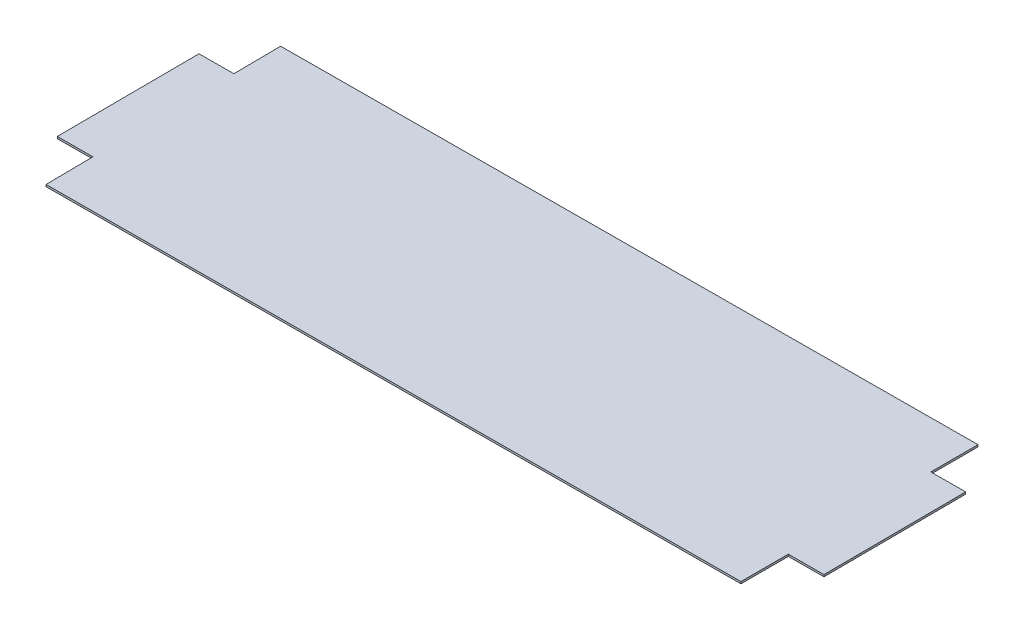
ISO-10303-21;
HEADER;
FILE_DESCRIPTION(('STEP AP214'),'2;1');
FILE_NAME('part.step','',(''),(''),'','','');
FILE_SCHEMA(('AUTOMOTIVE_DESIGN { 1 0 10303 214 1 1 1 1 }'));
ENDSEC;
DATA;
#1=APPLICATION_CONTEXT('core data for automotive mechanical design processes');
#2=APPLICATION_PROTOCOL_DEFINITION('international standard','automotive_design',2000,#1);
#3=PRODUCT_CONTEXT('',#1,'mechanical');
#4=PRODUCT('Part','Part','',(#3));
#5=PRODUCT_RELATED_PRODUCT_CATEGORY('part','',(#4));
#6=PRODUCT_DEFINITION_FORMATION('','',#4);
#7=PRODUCT_DEFINITION_CONTEXT('part definition',#1,'design');
#8=PRODUCT_DEFINITION('design','',#6,#7);
#9=PRODUCT_DEFINITION_SHAPE('','',#8);
#10=(LENGTH_UNIT() NAMED_UNIT(*) SI_UNIT(.MILLI.,.METRE.));
#11=(NAMED_UNIT(*) PLANE_ANGLE_UNIT() SI_UNIT($,.RADIAN.));
#12=(NAMED_UNIT(*) SI_UNIT($,.STERADIAN.) SOLID_ANGLE_UNIT());
#13=UNCERTAINTY_MEASURE_WITH_UNIT(LENGTH_MEASURE(1.E-05),#10,'distance_accuracy_value','');
#14=(GEOMETRIC_REPRESENTATION_CONTEXT(3) GLOBAL_UNCERTAINTY_ASSIGNED_CONTEXT((#13)) GLOBAL_UNIT_ASSIGNED_CONTEXT((#10,
#11,#12)) REPRESENTATION_CONTEXT('',''));
#15=CARTESIAN_POINT('',(0.,0.,0.));
#16=DIRECTION('',(0.,0.,1.));
#17=DIRECTION('',(1.,0.,0.));
#18=AXIS2_PLACEMENT_3D('',#15,#16,#17);
#19=CARTESIAN_POINT('',(-610.405271528689,1.94289029309402E-13,193.675));
#20=DIRECTION('',(0.,-1.,0.));
#21=DIRECTION('',(0.,0.,-1.));
#22=AXIS2_PLACEMENT_3D('',#19,#20,#21);
#23=PLANE('',#22);
#24=DIRECTION('',(0.999986563434071,0.,-0.00518391274192354));
#25=VECTOR('',#24,1.);
#26=CARTESIAN_POINT('',(-1189.15704506782,1.94289029309402E-13,310.976774826291));
#27=LINE('',#26,#25);
#28=CARTESIAN_POINT('',(-1165.7524817417,1.94289029309402E-13,310.855445982003));
#29=VERTEX_POINT('',#28);
#30=CARTESIAN_POINT('',(-1222.77001415093,1.94939550612893E-13,311.151023866324));
#31=VERTEX_POINT('',#30);
#32=EDGE_CURVE('E17',#29,#31,#27,.F.);
#33=ORIENTED_EDGE('',*,*,#32,.F.);
#34=DIRECTION('',(0.0103676861758763,0.,0.999946254097368));
#35=VECTOR('',#34,1.);
#36=CARTESIAN_POINT('',(-1165.22914877007,1.94289029309402E-13,361.330049066521));
#37=LINE('',#36,#35);
#38=CARTESIAN_POINT('',(-1164.96245343983,1.94668500069772E-13,387.052374369274));
#39=VERTEX_POINT('',#38);
#40=EDGE_CURVE('E164',#39,#29,#37,.F.);
#41=ORIENTED_EDGE('',*,*,#40,.F.);
#42=DIRECTION('',(0.999986563434072,0.,-0.0051839127419233));
#43=VECTOR('',#42,1.);
#44=CARTESIAN_POINT('',(-609.4149533625,1.96023752785379E-13,384.172425908263));
#45=LINE('',#44,#43);
#46=CARTESIAN_POINT('',(-53.8730188628722,1.94668500069772E-13,381.292506299107));
#47=VERTEX_POINT('',#46);
#48=EDGE_CURVE('E162',#47,#39,#45,.F.);
#49=ORIENTED_EDGE('',*,*,#48,.F.);
#50=DIRECTION('',(0.,0.,1.));
#51=VECTOR('',#50,1.);
#52=CARTESIAN_POINT('',(-53.8730188628722,1.94289029309402E-13,361.627768309912));
#53=LINE('',#52,#51);
#54=CARTESIAN_POINT('',(-53.8730188628722,1.94289029309402E-13,305.091482419026));
#55=VERTEX_POINT('',#54);
#56=EDGE_CURVE('E156',#47,#55,#53,.F.);
#57=ORIENTED_EDGE('',*,*,#56,.T.);
#58=DIRECTION('',(-0.999986563434071,0.,0.00518391274192366));
#59=VECTOR('',#58,1.);
#60=CARTESIAN_POINT('',(-30.1726465724989,1.94289029309402E-13,304.968620106274));
#61=LINE('',#60,#59);
#62=CARTESIAN_POINT('',(3.14451354636017,1.95590071916385E-13,304.795904534705));
#63=VERTEX_POINT('',#62);
#64=EDGE_CURVE('E151',#55,#63,#61,.F.);
#65=ORIENTED_EDGE('',*,*,#64,.T.);
#66=DIRECTION('',(-0.00518391274192348,0.,-0.999986563434072));
#67=VECTOR('',#66,1.);
#68=CARTESIAN_POINT('',(2.53553339700272,1.96023752785379E-13,187.322482995288));
#69=LINE('',#68,#67);
#70=CARTESIAN_POINT('',(1.95797601733439,1.94668500069772E-13,75.9105731053427));
#71=VERTEX_POINT('',#70);
#72=EDGE_CURVE('E147',#71,#63,#69,.F.);
#73=ORIENTED_EDGE('',*,*,#72,.F.);
#74=DIRECTION('',(-0.999986563434071,0.,0.00518391274192342));
#75=VECTOR('',#74,1.);
#76=CARTESIAN_POINT('',(-23.4628131862811,1.94289029309402E-13,76.0423540290881));
#77=LINE('',#76,#75);
#78=CARTESIAN_POINT('',(-53.8730188628722,1.94289029309402E-13,76.2));
#79=VERTEX_POINT('',#78);
#80=EDGE_CURVE('E139',#79,#71,#77,.F.);
#81=ORIENTED_EDGE('',*,*,#80,.F.);
#82=DIRECTION('',(0.,0.,-1.));
#83=VECTOR('',#82,1.);
#84=CARTESIAN_POINT('',(-53.8730188628722,1.94289029309402E-13,41.8810529172602));
#85=LINE('',#84,#83);
#86=CARTESIAN_POINT('',(-53.8730188628721,1.95590071916385E-13,0.287386898701172));
#87=VERTEX_POINT('',#86);
#88=EDGE_CURVE('E136',#87,#79,#85,.F.);
#89=ORIENTED_EDGE('',*,*,#88,.F.);
#90=DIRECTION('',(0.999986563434072,0.,-0.0051839127419233));
#91=VECTOR('',#90,1.);
#92=CARTESIAN_POINT('',(-611.390024117172,1.96023752785379E-13,3.17754523988095));
#93=LINE('',#92,#91);
#94=CARTESIAN_POINT('',(-1168.91259494918,1.94939550612893E-13,6.06773243291756));
#95=VERTEX_POINT('',#94);
#96=EDGE_CURVE('E129',#87,#95,#93,.F.);
#97=ORIENTED_EDGE('',*,*,#96,.T.);
#98=DIRECTION('',(-0.0103676861758764,0.,-0.999946254097368));
#99=VECTOR('',#98,1.);
#100=CARTESIAN_POINT('',(-1168.73533621879,1.94289029309402E-13,23.1640449998506));
#101=LINE('',#100,#99);
#102=CARTESIAN_POINT('',(-1168.12555679975,1.94289029309402E-13,81.9762655423045));
#103=VERTEX_POINT('',#102);
#104=EDGE_CURVE('E125',#95,#103,#101,.F.);
#105=ORIENTED_EDGE('',*,*,#104,.T.);
#106=DIRECTION('',(0.999986563434071,0.,-0.00518391274192379));
#107=VECTOR('',#106,1.);
#108=CARTESIAN_POINT('',(-1196.38264585544,1.94289029309402E-13,82.1227497945552));
#109=LINE('',#108,#107);
#110=CARTESIAN_POINT('',(-1223.95655167996,1.95047970830142E-13,82.2656924369618));
#111=VERTEX_POINT('',#110);
#112=EDGE_CURVE('E107',#103,#111,#109,.F.);
#113=ORIENTED_EDGE('',*,*,#112,.T.);
#114=DIRECTION('',(-0.00518391274192348,0.,-0.999986563434072));
#115=VECTOR('',#114,1.);
#116=CARTESIAN_POINT('',(-1223.37899430029,1.96023752785379E-13,193.677602326907));
#117=LINE('',#116,#115);
#118=EDGE_CURVE('E101',#111,#31,#117,.F.);
#119=ORIENTED_EDGE('',*,*,#118,.T.);
#120=EDGE_LOOP('',(#33,#41,#49,#57,#65,#73,#81,#89,#97,#105,#113,#119));
#121=FACE_BOUND('',#120,.T.);
#122=ADVANCED_FACE('F14',(#121),#23,.F.);
#123=CARTESIAN_POINT('',(-1189.15704506782,-3.1749999999998,310.976774826291));
#124=DIRECTION('',(0.00518391274192354,0.,0.999986563434071));
#125=DIRECTION('',(0.999986563434071,0.,-0.00518391274192354));
#126=AXIS2_PLACEMENT_3D('',#123,#124,#125);
#127=PLANE('',#126);
#128=DIRECTION('',(-0.999986563434071,0.,0.00518391274192392));
#129=VECTOR('',#128,1.);
#130=CARTESIAN_POINT('',(-1165.7524817417,-3.1749999999998,310.855445982003));
#131=LINE('',#130,#129);
#132=CARTESIAN_POINT('',(-1165.7524817417,-3.1749999999998,310.855445982003));
#133=VERTEX_POINT('',#132);
#134=CARTESIAN_POINT('',(-1222.77001415093,-3.1749999999998,311.151023866324));
#135=VERTEX_POINT('',#134);
#136=EDGE_CURVE('E168',#133,#135,#131,.T.);
#137=ORIENTED_EDGE('',*,*,#136,.F.);
#138=DIRECTION('',(0.,1.,0.));
#139=VECTOR('',#138,1.);
#140=CARTESIAN_POINT('',(-1165.75248174171,-3.1749999999998,310.855445982003));
#141=LINE('',#140,#139);
#142=EDGE_CURVE('E114',#29,#133,#141,.F.);
#143=ORIENTED_EDGE('',*,*,#142,.F.);
#144=ORIENTED_EDGE('',*,*,#32,.T.);
#145=DIRECTION('',(0.,1.,0.));
#146=VECTOR('',#145,1.);
#147=CARTESIAN_POINT('',(-1222.77001415093,-3.1749999999998,311.151023866324));
#148=LINE('',#147,#146);
#149=EDGE_CURVE('E109',#31,#135,#148,.F.);
#150=ORIENTED_EDGE('',*,*,#149,.T.);
#151=EDGE_LOOP('',(#137,#143,#144,#150));
#152=FACE_BOUND('',#151,.T.);
#153=ADVANCED_FACE('F111',(#152),#127,.T.);
#154=CARTESIAN_POINT('',(-1223.37899430029,-3.1749999999998,193.677602326907));
#155=DIRECTION('',(0.999986563434072,0.,-0.00518391274192348));
#156=DIRECTION('',(-0.00518391274192348,0.,-0.999986563434072));
#157=AXIS2_PLACEMENT_3D('',#154,#155,#156);
#158=PLANE('',#157);
#159=ORIENTED_EDGE('',*,*,#149,.F.);
#160=ORIENTED_EDGE('',*,*,#118,.F.);
#161=DIRECTION('',(0.,1.,0.));
#162=VECTOR('',#161,1.);
#163=CARTESIAN_POINT('',(-1223.95655167996,-3.1749999999998,82.2656924369618));
#164=LINE('',#163,#162);
#165=CARTESIAN_POINT('',(-1223.95655167996,-3.1749999999998,82.2656924369618));
#166=VERTEX_POINT('',#165);
#167=EDGE_CURVE('E120',#111,#166,#164,.F.);
#168=ORIENTED_EDGE('',*,*,#167,.T.);
#169=DIRECTION('',(-0.00518391274194227,0.,-0.999986563434071));
#170=VECTOR('',#169,1.);
#171=CARTESIAN_POINT('',(-1222.77001415093,-3.1749999999998,311.151023866324));
#172=LINE('',#171,#170);
#173=EDGE_CURVE('E118',#135,#166,#172,.T.);
#174=ORIENTED_EDGE('',*,*,#173,.F.);
#175=EDGE_LOOP('',(#159,#160,#168,#174));
#176=FACE_BOUND('',#175,.T.);
#177=ADVANCED_FACE('F116',(#176),#158,.F.);
#178=CARTESIAN_POINT('',(-1196.38264585544,-3.1749999999998,82.1227497945552));
#179=DIRECTION('',(0.00518391274192379,0.,0.999986563434071));
#180=DIRECTION('',(0.999986563434071,0.,-0.00518391274192379));
#181=AXIS2_PLACEMENT_3D('',#178,#179,#180);
#182=PLANE('',#181);
#183=DIRECTION('',(0.,1.,0.));
#184=VECTOR('',#183,1.);
#185=CARTESIAN_POINT('',(-1168.12555679975,-3.1749999999998,81.9762655423045));
#186=LINE('',#185,#184);
#187=CARTESIAN_POINT('',(-1168.12555679975,-3.1749999999998,81.9762655423045));
#188=VERTEX_POINT('',#187);
#189=EDGE_CURVE('E127',#103,#188,#186,.F.);
#190=ORIENTED_EDGE('',*,*,#189,.T.);
#191=DIRECTION('',(0.999986563434071,0.,-0.00518391274192459));
#192=VECTOR('',#191,1.);
#193=CARTESIAN_POINT('',(-1223.95655167996,-3.1749999999998,82.2656924369619));
#194=LINE('',#193,#192);
#195=EDGE_CURVE('E171',#166,#188,#194,.T.);
#196=ORIENTED_EDGE('',*,*,#195,.F.);
#197=ORIENTED_EDGE('',*,*,#167,.F.);
#198=ORIENTED_EDGE('',*,*,#112,.F.);
#199=EDGE_LOOP('',(#190,#196,#197,#198));
#200=FACE_BOUND('',#199,.T.);
#201=ADVANCED_FACE('F241',(#200),#182,.F.);
#202=CARTESIAN_POINT('',(-1168.73533621879,-3.1749999999998,23.1640449998506));
#203=DIRECTION('',(0.999946254097368,0.,-0.0103676861758764));
#204=DIRECTION('',(-0.0103676861758764,0.,-0.999946254097368));
#205=AXIS2_PLACEMENT_3D('',#202,#203,#204);
#206=PLANE('',#205);
#207=ORIENTED_EDGE('',*,*,#189,.F.);
#208=ORIENTED_EDGE('',*,*,#104,.F.);
#209=DIRECTION('',(0.,1.,0.));
#210=VECTOR('',#209,1.);
#211=CARTESIAN_POINT('',(-1168.91259494918,-3.1749999999998,6.0677324329176));
#212=LINE('',#211,#210);
#213=CARTESIAN_POINT('',(-1168.91259494918,-3.1749999999998,6.06773243291754));
#214=VERTEX_POINT('',#213);
#215=EDGE_CURVE('E131',#95,#214,#212,.F.);
#216=ORIENTED_EDGE('',*,*,#215,.T.);
#217=DIRECTION('',(-0.0103676861759444,0.,-0.999946254097368));
#218=VECTOR('',#217,1.);
#219=CARTESIAN_POINT('',(-1168.12555679975,-3.1749999999998,81.9762655423045));
#220=LINE('',#219,#218);
#221=EDGE_CURVE('E174',#188,#214,#220,.T.);
#222=ORIENTED_EDGE('',*,*,#221,.F.);
#223=EDGE_LOOP('',(#207,#208,#216,#222));
#224=FACE_BOUND('',#223,.T.);
#225=ADVANCED_FACE('F237',(#224),#206,.F.);
#226=CARTESIAN_POINT('',(-611.390024117172,-3.1749999999998,3.17754523988095));
#227=DIRECTION('',(0.0051839127419233,0.,0.999986563434072));
#228=DIRECTION('',(0.999986563434072,0.,-0.0051839127419233));
#229=AXIS2_PLACEMENT_3D('',#226,#227,#228);
#230=PLANE('',#229);
#231=DIRECTION('',(0.999986563434071,0.,-0.00518391274192324));
#232=VECTOR('',#231,1.);
#233=CARTESIAN_POINT('',(-1168.91259494918,-3.1749999999998,6.06773243291753));
#234=LINE('',#233,#232);
#235=CARTESIAN_POINT('',(-53.8730188628721,-3.1749999999998,0.287386898701172));
#236=VERTEX_POINT('',#235);
#237=EDGE_CURVE('E177',#214,#236,#234,.T.);
#238=ORIENTED_EDGE('',*,*,#237,.F.);
#239=ORIENTED_EDGE('',*,*,#215,.F.);
#240=ORIENTED_EDGE('',*,*,#96,.F.);
#241=DIRECTION('',(0.,1.,0.));
#242=VECTOR('',#241,1.);
#243=CARTESIAN_POINT('',(-53.8730188628722,-3.1749999999998,0.287386898701177));
#244=LINE('',#243,#242);
#245=EDGE_CURVE('E133',#236,#87,#244,.T.);
#246=ORIENTED_EDGE('',*,*,#245,.F.);
#247=EDGE_LOOP('',(#238,#239,#240,#246));
#248=FACE_BOUND('',#247,.T.);
#249=ADVANCED_FACE('F233',(#248),#230,.F.);
#250=CARTESIAN_POINT('',(-53.8730188628722,-3.1749999999998,41.8810529172602));
#251=DIRECTION('',(1.,0.,0.));
#252=DIRECTION('',(0.,0.,-1.));
#253=AXIS2_PLACEMENT_3D('',#250,#251,#252);
#254=PLANE('',#253);
#255=DIRECTION('',(0.,1.,0.));
#256=VECTOR('',#255,1.);
#257=CARTESIAN_POINT('',(-53.8730188628722,-3.1749999999998,76.2));
#258=LINE('',#257,#256);
#259=CARTESIAN_POINT('',(-53.8730188628722,-3.1749999999998,76.2));
#260=VERTEX_POINT('',#259);
#261=EDGE_CURVE('E141',#260,#79,#258,.T.);
#262=ORIENTED_EDGE('',*,*,#261,.F.);
#263=DIRECTION('',(0.,0.,-1.));
#264=VECTOR('',#263,1.);
#265=CARTESIAN_POINT('',(-53.8730188628722,-3.1749999999998,193.675));
#266=LINE('',#265,#264);
#267=EDGE_CURVE('E180',#236,#260,#266,.F.);
#268=ORIENTED_EDGE('',*,*,#267,.F.);
#269=ORIENTED_EDGE('',*,*,#245,.T.);
#270=ORIENTED_EDGE('',*,*,#88,.T.);
#271=EDGE_LOOP('',(#262,#268,#269,#270));
#272=FACE_BOUND('',#271,.T.);
#273=ADVANCED_FACE('F229',(#272),#254,.T.);
#274=CARTESIAN_POINT('',(-23.4628131862811,-3.1749999999998,76.0423540290881));
#275=DIRECTION('',(-0.00518391274192342,0.,-0.999986563434071));
#276=DIRECTION('',(-0.999986563434071,0.,0.00518391274192342));
#277=AXIS2_PLACEMENT_3D('',#274,#275,#276);
#278=PLANE('',#277);
#279=DIRECTION('',(0.999986563434071,0.,-0.00518391274192317));
#280=VECTOR('',#279,1.);
#281=CARTESIAN_POINT('',(-53.8730188628722,-3.1749999999998,76.2));
#282=LINE('',#281,#280);
#283=CARTESIAN_POINT('',(1.95797601733439,-3.1749999999998,75.9105731053427));
#284=VERTEX_POINT('',#283);
#285=EDGE_CURVE('E183',#260,#284,#282,.T.);
#286=ORIENTED_EDGE('',*,*,#285,.F.);
#287=ORIENTED_EDGE('',*,*,#261,.T.);
#288=ORIENTED_EDGE('',*,*,#80,.T.);
#289=DIRECTION('',(0.,1.,0.));
#290=VECTOR('',#289,1.);
#291=CARTESIAN_POINT('',(1.95797601733439,-3.1749999999998,75.9105731053427));
#292=LINE('',#291,#290);
#293=EDGE_CURVE('E144',#284,#71,#292,.T.);
#294=ORIENTED_EDGE('',*,*,#293,.F.);
#295=EDGE_LOOP('',(#286,#287,#288,#294));
#296=FACE_BOUND('',#295,.T.);
#297=ADVANCED_FACE('F225',(#296),#278,.T.);
#298=CARTESIAN_POINT('',(2.53553339700272,-3.1749999999998,187.322482995288));
#299=DIRECTION('',(0.999986563434072,0.,-0.00518391274192348));
#300=DIRECTION('',(-0.00518391274192348,0.,-0.999986563434072));
#301=AXIS2_PLACEMENT_3D('',#298,#299,#300);
#302=PLANE('',#301);
#303=ORIENTED_EDGE('',*,*,#72,.T.);
#304=DIRECTION('',(0.,1.,0.));
#305=VECTOR('',#304,1.);
#306=CARTESIAN_POINT('',(3.14451354636019,-3.1749999999998,304.795904534705));
#307=LINE('',#306,#305);
#308=CARTESIAN_POINT('',(3.14451354636017,-3.1749999999998,304.795904534705));
#309=VERTEX_POINT('',#308);
#310=EDGE_CURVE('E149',#63,#309,#307,.F.);
#311=ORIENTED_EDGE('',*,*,#310,.T.);
#312=DIRECTION('',(0.00518391274192335,0.,0.999986563434071));
#313=VECTOR('',#312,1.);
#314=CARTESIAN_POINT('',(1.95797601733438,-3.1749999999998,75.9105731053427));
#315=LINE('',#314,#313);
#316=EDGE_CURVE('E186',#284,#309,#315,.T.);
#317=ORIENTED_EDGE('',*,*,#316,.F.);
#318=ORIENTED_EDGE('',*,*,#293,.T.);
#319=EDGE_LOOP('',(#303,#311,#317,#318));
#320=FACE_BOUND('',#319,.T.);
#321=ADVANCED_FACE('F221',(#320),#302,.T.);
#322=CARTESIAN_POINT('',(-30.1726465724989,-3.1749999999998,304.968620106274));
#323=DIRECTION('',(-0.00518391274192366,0.,-0.999986563434071));
#324=DIRECTION('',(-0.999986563434071,0.,0.00518391274192366));
#325=AXIS2_PLACEMENT_3D('',#322,#323,#324);
#326=PLANE('',#325);
#327=DIRECTION('',(0.,1.,0.));
#328=VECTOR('',#327,1.);
#329=CARTESIAN_POINT('',(-53.8730188628722,-3.1749999999998,305.091482419026));
#330=LINE('',#329,#328);
#331=CARTESIAN_POINT('',(-53.8730188628722,-3.1749999999998,305.091482419026));
#332=VERTEX_POINT('',#331);
#333=EDGE_CURVE('E154',#55,#332,#330,.F.);
#334=ORIENTED_EDGE('',*,*,#333,.T.);
#335=DIRECTION('',(-0.999986563434071,0.,0.0051839127419237));
#336=VECTOR('',#335,1.);
#337=CARTESIAN_POINT('',(3.14451354636014,-3.1749999999998,304.795904534705));
#338=LINE('',#337,#336);
#339=EDGE_CURVE('E189',#309,#332,#338,.T.);
#340=ORIENTED_EDGE('',*,*,#339,.F.);
#341=ORIENTED_EDGE('',*,*,#310,.F.);
#342=ORIENTED_EDGE('',*,*,#64,.F.);
#343=EDGE_LOOP('',(#334,#340,#341,#342));
#344=FACE_BOUND('',#343,.T.);
#345=ADVANCED_FACE('F218',(#344),#326,.F.);
#346=CARTESIAN_POINT('',(-53.8730188628722,-3.1749999999998,361.627768309912));
#347=DIRECTION('',(-1.,0.,0.));
#348=DIRECTION('',(0.,0.,1.));
#349=AXIS2_PLACEMENT_3D('',#346,#347,#348);
#350=PLANE('',#349);
#351=DIRECTION('',(0.,1.,0.));
#352=VECTOR('',#351,1.);
#353=CARTESIAN_POINT('',(-53.8730188628721,-3.1749999999998,381.292506299108));
#354=LINE('',#353,#352);
#355=CARTESIAN_POINT('',(-53.8730188628722,-3.1749999999998,381.292506299107));
#356=VERTEX_POINT('',#355);
#357=EDGE_CURVE('E159',#356,#47,#354,.T.);
#358=ORIENTED_EDGE('',*,*,#357,.F.);
#359=DIRECTION('',(0.,0.,-1.));
#360=VECTOR('',#359,1.);
#361=CARTESIAN_POINT('',(-53.8730188628722,-3.1749999999998,193.675));
#362=LINE('',#361,#360);
#363=EDGE_CURVE('E192',#332,#356,#362,.F.);
#364=ORIENTED_EDGE('',*,*,#363,.F.);
#365=ORIENTED_EDGE('',*,*,#333,.F.);
#366=ORIENTED_EDGE('',*,*,#56,.F.);
#367=EDGE_LOOP('',(#358,#364,#365,#366));
#368=FACE_BOUND('',#367,.T.);
#369=ADVANCED_FACE('F202',(#368),#350,.F.);
#370=CARTESIAN_POINT('',(-609.4149533625,-3.1749999999998,384.172425908263));
#371=DIRECTION('',(0.0051839127419233,0.,0.999986563434072));
#372=DIRECTION('',(0.999986563434072,0.,-0.0051839127419233));
#373=AXIS2_PLACEMENT_3D('',#370,#371,#372);
#374=PLANE('',#373);
#375=ORIENTED_EDGE('',*,*,#357,.T.);
#376=ORIENTED_EDGE('',*,*,#48,.T.);
#377=DIRECTION('',(0.,1.,0.));
#378=VECTOR('',#377,1.);
#379=CARTESIAN_POINT('',(-1164.96245343984,-3.1749999999998,387.052374369274));
#380=LINE('',#379,#378);
#381=CARTESIAN_POINT('',(-1164.96245343983,-3.1749999999998,387.052374369274));
#382=VERTEX_POINT('',#381);
#383=EDGE_CURVE('E32',#382,#39,#380,.T.);
#384=ORIENTED_EDGE('',*,*,#383,.F.);
#385=DIRECTION('',(-0.999986563434071,0.,0.00518391274192337));
#386=VECTOR('',#385,1.);
#387=CARTESIAN_POINT('',(-53.8730188628722,-3.1749999999998,381.292506299107));
#388=LINE('',#387,#386);
#389=EDGE_CURVE('E23',#356,#382,#388,.T.);
#390=ORIENTED_EDGE('',*,*,#389,.F.);
#391=EDGE_LOOP('',(#375,#376,#384,#390));
#392=FACE_BOUND('',#391,.T.);
#393=ADVANCED_FACE('F199',(#392),#374,.T.);
#394=CARTESIAN_POINT('',(-1165.22914877007,-3.1749999999998,361.330049066521));
#395=DIRECTION('',(-0.999946254097368,0.,0.0103676861758763));
#396=DIRECTION('',(0.0103676861758763,0.,0.999946254097368));
#397=AXIS2_PLACEMENT_3D('',#394,#395,#396);
#398=PLANE('',#397);
#399=DIRECTION('',(-0.010367686175888,0.,-0.999946254097368));
#400=VECTOR('',#399,1.);
#401=CARTESIAN_POINT('',(-1164.96245343983,-3.1749999999998,387.052374369274));
#402=LINE('',#401,#400);
#403=EDGE_CURVE('E9',#382,#133,#402,.T.);
#404=ORIENTED_EDGE('',*,*,#403,.F.);
#405=ORIENTED_EDGE('',*,*,#383,.T.);
#406=ORIENTED_EDGE('',*,*,#40,.T.);
#407=ORIENTED_EDGE('',*,*,#142,.T.);
#408=EDGE_LOOP('',(#404,#405,#406,#407));
#409=FACE_BOUND('',#408,.T.);
#410=ADVANCED_FACE('F205',(#409),#398,.T.);
#411=CARTESIAN_POINT('',(-610.405271528689,-3.1749999999998,193.675));
#412=DIRECTION('',(0.,-1.,0.));
#413=DIRECTION('',(0.,0.,-1.));
#414=AXIS2_PLACEMENT_3D('',#411,#412,#413);
#415=PLANE('',#414);
#416=ORIENTED_EDGE('',*,*,#389,.T.);
#417=ORIENTED_EDGE('',*,*,#403,.T.);
#418=ORIENTED_EDGE('',*,*,#136,.T.);
#419=ORIENTED_EDGE('',*,*,#173,.T.);
#420=ORIENTED_EDGE('',*,*,#195,.T.);
#421=ORIENTED_EDGE('',*,*,#221,.T.);
#422=ORIENTED_EDGE('',*,*,#237,.T.);
#423=ORIENTED_EDGE('',*,*,#267,.T.);
#424=ORIENTED_EDGE('',*,*,#285,.T.);
#425=ORIENTED_EDGE('',*,*,#316,.T.);
#426=ORIENTED_EDGE('',*,*,#339,.T.);
#427=ORIENTED_EDGE('',*,*,#363,.T.);
#428=EDGE_LOOP('',(#416,#417,#418,#419,#420,#421,#422,#423,#424,#425,#426,#427));
#429=FACE_BOUND('',#428,.T.);
#430=ADVANCED_FACE('F197',(#429),#415,.T.);
#431=CLOSED_SHELL('',(#122,#153,#177,#201,#225,#249,#273,#297,#321,#345,#369,#393,#410,#430));
#432=MANIFOLD_SOLID_BREP('B1',#431);
#433=ADVANCED_BREP_SHAPE_REPRESENTATION('',(#18,#432),#14);
#434=SHAPE_DEFINITION_REPRESENTATION(#9,#433);
ENDSEC;
END-ISO-10303-21;
